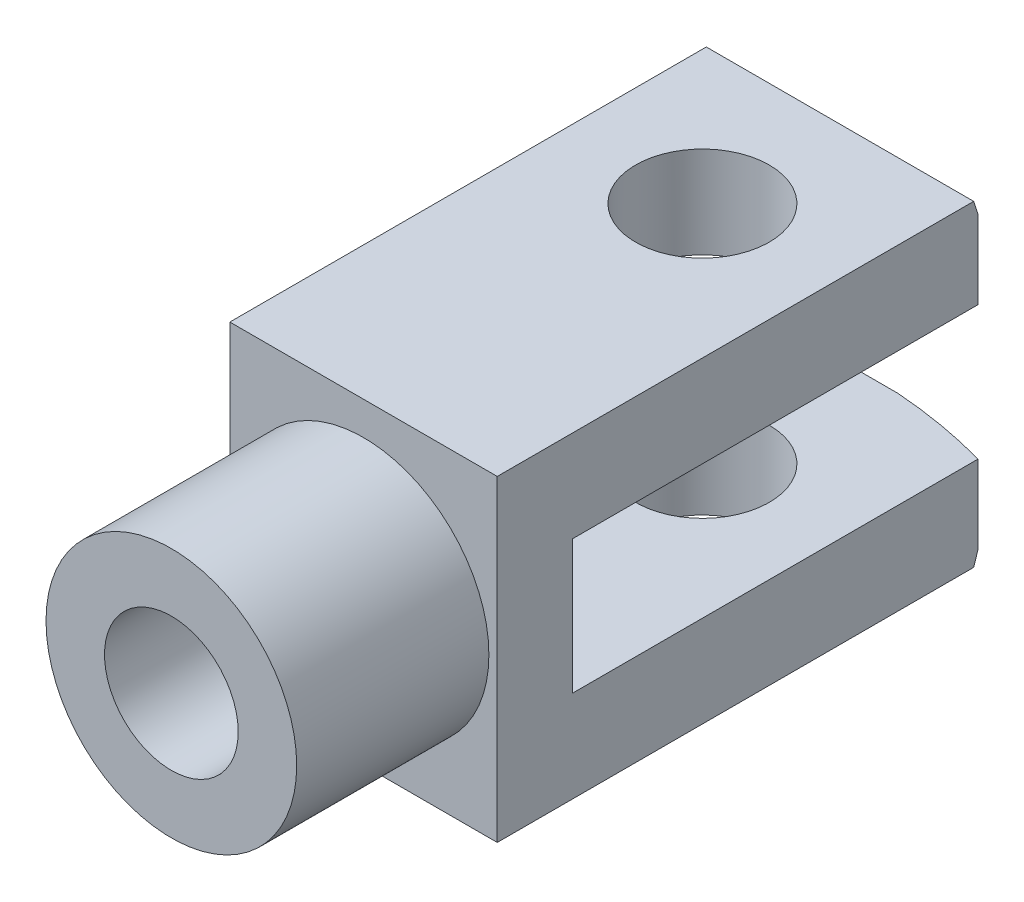
ISO-10303-21;
HEADER;
FILE_DESCRIPTION(('STEP AP214'),'2;1');
FILE_NAME('part.step','',(''),(''),'','','');
FILE_SCHEMA(('AUTOMOTIVE_DESIGN { 1 0 10303 214 1 1 1 1 }'));
ENDSEC;
DATA;
#1=APPLICATION_CONTEXT('core data for automotive mechanical design processes');
#2=APPLICATION_PROTOCOL_DEFINITION('international standard','automotive_design',2000,#1);
#3=PRODUCT_CONTEXT('',#1,'mechanical');
#4=PRODUCT('Part','Part','',(#3));
#5=PRODUCT_RELATED_PRODUCT_CATEGORY('part','',(#4));
#6=PRODUCT_DEFINITION_FORMATION('','',#4);
#7=PRODUCT_DEFINITION_CONTEXT('part definition',#1,'design');
#8=PRODUCT_DEFINITION('design','',#6,#7);
#9=PRODUCT_DEFINITION_SHAPE('','',#8);
#10=(LENGTH_UNIT() NAMED_UNIT(*) SI_UNIT(.MILLI.,.METRE.));
#11=(NAMED_UNIT(*) PLANE_ANGLE_UNIT() SI_UNIT($,.RADIAN.));
#12=(NAMED_UNIT(*) SI_UNIT($,.STERADIAN.) SOLID_ANGLE_UNIT());
#13=UNCERTAINTY_MEASURE_WITH_UNIT(LENGTH_MEASURE(1.E-05),#10,'distance_accuracy_value','');
#14=(GEOMETRIC_REPRESENTATION_CONTEXT(3) GLOBAL_UNCERTAINTY_ASSIGNED_CONTEXT((#13)) GLOBAL_UNIT_ASSIGNED_CONTEXT((#10,
#11,#12)) REPRESENTATION_CONTEXT('',''));
#15=CARTESIAN_POINT('',(0.,0.,0.));
#16=DIRECTION('',(0.,0.,1.));
#17=DIRECTION('',(1.,0.,0.));
#18=AXIS2_PLACEMENT_3D('',#15,#16,#17);
#19=CARTESIAN_POINT('',(8.00000000000002,0.,18.2051282051281));
#20=DIRECTION('',(0.,0.,1.));
#21=DIRECTION('',(1.,0.,0.));
#22=AXIS2_PLACEMENT_3D('',#19,#20,#21);
#23=PLANE('',#22);
#24=DIRECTION('',(1.,0.,0.));
#25=VECTOR('',#24,1.);
#26=CARTESIAN_POINT('',(69.8292176136682,8.,18.2051282051281));
#27=LINE('',#26,#25);
#28=CARTESIAN_POINT('',(-16.,8.,18.2051282051281));
#29=VERTEX_POINT('',#28);
#30=CARTESIAN_POINT('',(0.,8.,18.2051282051281));
#31=VERTEX_POINT('',#30);
#32=EDGE_CURVE('E148',#29,#31,#27,.T.);
#33=ORIENTED_EDGE('',*,*,#32,.T.);
#34=CARTESIAN_POINT('',(0.,0.,18.2051282051281));
#35=DIRECTION('',(0.,0.,1.));
#36=DIRECTION('',(1.,0.,0.));
#37=AXIS2_PLACEMENT_3D('',#34,#35,#36);
#38=CIRCLE('',#37,8.);
#39=CARTESIAN_POINT('',(0.,-8.,18.2051282051281));
#40=VERTEX_POINT('',#39);
#41=EDGE_CURVE('E56',#31,#40,#38,.T.);
#42=ORIENTED_EDGE('',*,*,#41,.T.);
#43=DIRECTION('',(-1.,0.,0.));
#44=VECTOR('',#43,1.);
#45=CARTESIAN_POINT('',(69.8292176136682,-8.,18.2051282051281));
#46=LINE('',#45,#44);
#47=CARTESIAN_POINT('',(-16.,-8.,18.2051282051281));
#48=VERTEX_POINT('',#47);
#49=EDGE_CURVE('E145',#40,#48,#46,.T.);
#50=ORIENTED_EDGE('',*,*,#49,.T.);
#51=DIRECTION('',(0.,-1.,0.));
#52=VECTOR('',#51,1.);
#53=CARTESIAN_POINT('',(-16.,0.,18.2051282051281));
#54=LINE('',#53,#52);
#55=EDGE_CURVE('E255',#29,#48,#54,.T.);
#56=ORIENTED_EDGE('',*,*,#55,.F.);
#57=EDGE_LOOP('',(#33,#42,#50,#56));
#58=FACE_BOUND('',#57,.T.);
#59=ADVANCED_FACE('F37',(#58),#23,.F.);
#60=CARTESIAN_POINT('',(69.8292176136682,-8.,18.2051282051281));
#61=DIRECTION('',(0.,-1.,0.));
#62=DIRECTION('',(0.,0.,-1.));
#63=AXIS2_PLACEMENT_3D('',#60,#61,#62);
#64=PLANE('',#63);
#65=ORIENTED_EDGE('',*,*,#49,.F.);
#66=CARTESIAN_POINT('',(16.,-8.,18.2051282051281));
#67=VERTEX_POINT('',#66);
#68=EDGE_CURVE('E156',#67,#40,#46,.T.);
#69=ORIENTED_EDGE('',*,*,#68,.F.);
#70=DIRECTION('',(0.,0.,1.));
#71=VECTOR('',#70,1.);
#72=CARTESIAN_POINT('',(16.,-8.,18.2051282051281));
#73=LINE('',#72,#71);
#74=CARTESIAN_POINT('',(16.,-8.,-30.3252081160688));
#75=VERTEX_POINT('',#74);
#76=EDGE_CURVE('E248',#75,#67,#73,.T.);
#77=ORIENTED_EDGE('',*,*,#76,.F.);
#78=CARTESIAN_POINT('',(0.,-8.,27.2051282051281));
#79=DIRECTION('',(0.,-1.,0.));
#80=DIRECTION('',(0.,0.,-1.));
#81=AXIS2_PLACEMENT_3D('',#78,#79,#80);
#82=CIRCLE('',#81,59.7138141239532);
#83=CARTESIAN_POINT('',(4.38521309113406,-8.,-32.3474494332527));
#84=VERTEX_POINT('',#83);
#85=EDGE_CURVE('E227',#84,#75,#82,.T.);
#86=ORIENTED_EDGE('',*,*,#85,.F.);
#87=DIRECTION('',(1.,0.,0.));
#88=VECTOR('',#87,1.);
#89=CARTESIAN_POINT('',(-35.,-8.,-32.3474494332527));
#90=LINE('',#89,#88);
#91=CARTESIAN_POINT('',(-4.38521309113406,-8.,-32.3474494332527));
#92=VERTEX_POINT('',#91);
#93=EDGE_CURVE('E64',#92,#84,#90,.T.);
#94=ORIENTED_EDGE('',*,*,#93,.F.);
#95=CARTESIAN_POINT('',(-16.,-8.,-30.3252081160688));
#96=VERTEX_POINT('',#95);
#97=EDGE_CURVE('E228',#96,#92,#82,.T.);
#98=ORIENTED_EDGE('',*,*,#97,.F.);
#99=DIRECTION('',(0.,0.,-1.));
#100=VECTOR('',#99,1.);
#101=CARTESIAN_POINT('',(-16.,-8.,18.2051282051281));
#102=LINE('',#101,#100);
#103=EDGE_CURVE('E159',#48,#96,#102,.T.);
#104=ORIENTED_EDGE('',*,*,#103,.F.);
#105=EDGE_LOOP('',(#65,#69,#77,#86,#94,#98,#104));
#106=FACE_BOUND('',#105,.T.);
#107=CARTESIAN_POINT('',(0.,-8.,-13.3474494332527));
#108=DIRECTION('',(0.,-1.,0.));
#109=DIRECTION('',(0.,0.,-1.));
#110=AXIS2_PLACEMENT_3D('',#107,#108,#109);
#111=CIRCLE('',#110,8.);
#112=CARTESIAN_POINT('',(0.,-8.,-21.3474494332527));
#113=VERTEX_POINT('',#112);
#114=EDGE_CURVE('E346',#113,#113,#111,.T.);
#115=ORIENTED_EDGE('',*,*,#114,.T.);
#116=EDGE_LOOP('',(#115));
#117=FACE_BOUND('',#116,.T.);
#118=ADVANCED_FACE('F153',(#106,#117),#64,.F.);
#119=CARTESIAN_POINT('',(69.8292176136682,8.,18.2051282051281));
#120=DIRECTION('',(0.,1.,0.));
#121=DIRECTION('',(0.,0.,1.));
#122=AXIS2_PLACEMENT_3D('',#119,#120,#121);
#123=PLANE('',#122);
#124=CARTESIAN_POINT('',(16.,8.,18.2051282051281));
#125=VERTEX_POINT('',#124);
#126=EDGE_CURVE('E258',#31,#125,#27,.T.);
#127=ORIENTED_EDGE('',*,*,#126,.F.);
#128=ORIENTED_EDGE('',*,*,#32,.F.);
#129=DIRECTION('',(0.,0.,1.));
#130=VECTOR('',#129,1.);
#131=CARTESIAN_POINT('',(-16.,8.,18.2051282051281));
#132=LINE('',#131,#130);
#133=CARTESIAN_POINT('',(-16.,8.,-30.3252081160688));
#134=VERTEX_POINT('',#133);
#135=EDGE_CURVE('E257',#134,#29,#132,.T.);
#136=ORIENTED_EDGE('',*,*,#135,.F.);
#137=CARTESIAN_POINT('',(0.,8.,27.2051282051281));
#138=DIRECTION('',(0.,1.,0.));
#139=DIRECTION('',(0.,0.,1.));
#140=AXIS2_PLACEMENT_3D('',#137,#138,#139);
#141=CIRCLE('',#140,59.7138141239532);
#142=CARTESIAN_POINT('',(-4.38521309113406,8.,-32.3474494332527));
#143=VERTEX_POINT('',#142);
#144=EDGE_CURVE('E233',#143,#134,#141,.T.);
#145=ORIENTED_EDGE('',*,*,#144,.F.);
#146=DIRECTION('',(1.,0.,0.));
#147=VECTOR('',#146,1.);
#148=CARTESIAN_POINT('',(-35.,8.,-32.3474494332527));
#149=LINE('',#148,#147);
#150=CARTESIAN_POINT('',(4.38521309113406,8.,-32.3474494332527));
#151=VERTEX_POINT('',#150);
#152=EDGE_CURVE('E215',#151,#143,#149,.F.);
#153=ORIENTED_EDGE('',*,*,#152,.F.);
#154=CARTESIAN_POINT('',(16.,8.,-30.3252081160688));
#155=VERTEX_POINT('',#154);
#156=EDGE_CURVE('E235',#155,#151,#141,.T.);
#157=ORIENTED_EDGE('',*,*,#156,.F.);
#158=DIRECTION('',(0.,0.,-1.));
#159=VECTOR('',#158,1.);
#160=CARTESIAN_POINT('',(16.,8.,18.2051282051281));
#161=LINE('',#160,#159);
#162=EDGE_CURVE('E245',#125,#155,#161,.T.);
#163=ORIENTED_EDGE('',*,*,#162,.F.);
#164=EDGE_LOOP('',(#127,#128,#136,#145,#153,#157,#163));
#165=FACE_BOUND('',#164,.T.);
#166=CARTESIAN_POINT('',(0.,8.,-13.3474494332527));
#167=DIRECTION('',(0.,1.,0.));
#168=DIRECTION('',(0.,0.,1.));
#169=AXIS2_PLACEMENT_3D('',#166,#167,#168);
#170=CIRCLE('',#169,8.);
#171=CARTESIAN_POINT('',(0.,8.,-5.3474494332527));
#172=VERTEX_POINT('',#171);
#173=EDGE_CURVE('E341',#172,#172,#170,.T.);
#174=ORIENTED_EDGE('',*,*,#173,.T.);
#175=EDGE_LOOP('',(#174));
#176=FACE_BOUND('',#175,.T.);
#177=ADVANCED_FACE('F266',(#165,#176),#123,.F.);
#178=CARTESIAN_POINT('',(60.0251154272219,18.9679364750024,50.2051282051281));
#179=DIRECTION('',(0.,1.,0.));
#180=DIRECTION('',(0.,0.,1.));
#181=AXIS2_PLACEMENT_3D('',#178,#179,#180);
#182=PLANE('',#181);
#183=CARTESIAN_POINT('',(0.,18.9679364750024,-13.3474494332527));
#184=DIRECTION('',(0.,-1.,0.));
#185=DIRECTION('',(0.,0.,-1.));
#186=AXIS2_PLACEMENT_3D('',#183,#184,#185);
#187=CIRCLE('',#186,8.);
#188=CARTESIAN_POINT('',(0.,18.9679364750024,-21.3474494332527));
#189=VERTEX_POINT('',#188);
#190=EDGE_CURVE('E338',#189,#189,#187,.T.);
#191=ORIENTED_EDGE('',*,*,#190,.T.);
#192=EDGE_LOOP('',(#191));
#193=FACE_BOUND('',#192,.T.);
#194=DIRECTION('',(0.,0.,-1.));
#195=VECTOR('',#194,1.);
#196=CARTESIAN_POINT('',(16.,18.9679364750024,50.2051282051281));
#197=LINE('',#196,#195);
#198=CARTESIAN_POINT('',(16.,18.9679364750024,27.2051282051281));
#199=VERTEX_POINT('',#198);
#200=CARTESIAN_POINT('',(16.,18.9679364750024,-29.810017933908));
#201=VERTEX_POINT('',#200);
#202=EDGE_CURVE('E241',#199,#201,#197,.T.);
#203=ORIENTED_EDGE('',*,*,#202,.T.);
#204=DIRECTION('',(1.,0.,0.));
#205=VECTOR('',#204,1.);
#206=CARTESIAN_POINT('',(-35.,18.9679364750024,-29.810017933908));
#207=LINE('',#206,#205);
#208=CARTESIAN_POINT('',(-16.,18.9679364750024,-29.810017933908));
#209=VERTEX_POINT('',#208);
#210=EDGE_CURVE('E281',#201,#209,#207,.F.);
#211=ORIENTED_EDGE('',*,*,#210,.T.);
#212=DIRECTION('',(0.,0.,1.));
#213=VECTOR('',#212,1.);
#214=CARTESIAN_POINT('',(-16.,18.9679364750024,50.2051282051281));
#215=LINE('',#214,#213);
#216=CARTESIAN_POINT('',(-16.,18.9679364750024,27.2051282051281));
#217=VERTEX_POINT('',#216);
#218=EDGE_CURVE('E253',#209,#217,#215,.T.);
#219=ORIENTED_EDGE('',*,*,#218,.T.);
#220=DIRECTION('',(1.,0.,0.));
#221=VECTOR('',#220,1.);
#222=CARTESIAN_POINT('',(15.,18.9679364750024,27.2051282051281));
#223=LINE('',#222,#221);
#224=EDGE_CURVE('E174',#217,#199,#223,.T.);
#225=ORIENTED_EDGE('',*,*,#224,.T.);
#226=EDGE_LOOP('',(#203,#211,#219,#225));
#227=FACE_BOUND('',#226,.T.);
#228=ADVANCED_FACE('F280',(#193,#227),#182,.T.);
#229=CARTESIAN_POINT('',(60.0251154272219,-18.9679364750024,50.2051282051281));
#230=DIRECTION('',(0.,-1.,0.));
#231=DIRECTION('',(0.,0.,-1.));
#232=AXIS2_PLACEMENT_3D('',#229,#230,#231);
#233=PLANE('',#232);
#234=CARTESIAN_POINT('',(0.,-18.9679364750024,-13.3474494332527));
#235=DIRECTION('',(0.,-1.,0.));
#236=DIRECTION('',(0.,0.,-1.));
#237=AXIS2_PLACEMENT_3D('',#234,#235,#236);
#238=CIRCLE('',#237,8.);
#239=CARTESIAN_POINT('',(0.,-18.9679364750024,-21.3474494332527));
#240=VERTEX_POINT('',#239);
#241=EDGE_CURVE('E149',#240,#240,#238,.T.);
#242=ORIENTED_EDGE('',*,*,#241,.F.);
#243=EDGE_LOOP('',(#242));
#244=FACE_BOUND('',#243,.T.);
#245=DIRECTION('',(0.,0.,-1.));
#246=VECTOR('',#245,1.);
#247=CARTESIAN_POINT('',(-16.,-18.9679364750024,50.2051282051281));
#248=LINE('',#247,#246);
#249=CARTESIAN_POINT('',(-16.,-18.9679364750024,27.2051282051281));
#250=VERTEX_POINT('',#249);
#251=CARTESIAN_POINT('',(-16.,-18.9679364750024,-29.810017933908));
#252=VERTEX_POINT('',#251);
#253=EDGE_CURVE('E182',#250,#252,#248,.T.);
#254=ORIENTED_EDGE('',*,*,#253,.T.);
#255=DIRECTION('',(1.,0.,0.));
#256=VECTOR('',#255,1.);
#257=CARTESIAN_POINT('',(-35.,-18.9679364750024,-29.810017933908));
#258=LINE('',#257,#256);
#259=CARTESIAN_POINT('',(16.,-18.9679364750024,-29.810017933908));
#260=VERTEX_POINT('',#259);
#261=EDGE_CURVE('E224',#252,#260,#258,.T.);
#262=ORIENTED_EDGE('',*,*,#261,.T.);
#263=DIRECTION('',(0.,0.,1.));
#264=VECTOR('',#263,1.);
#265=CARTESIAN_POINT('',(16.,-18.9679364750024,50.2051282051281));
#266=LINE('',#265,#264);
#267=CARTESIAN_POINT('',(16.,-18.9679364750024,27.2051282051281));
#268=VERTEX_POINT('',#267);
#269=EDGE_CURVE('E180',#260,#268,#266,.T.);
#270=ORIENTED_EDGE('',*,*,#269,.T.);
#271=DIRECTION('',(-1.,0.,0.));
#272=VECTOR('',#271,1.);
#273=CARTESIAN_POINT('',(15.,-18.9679364750024,27.2051282051281));
#274=LINE('',#273,#272);
#275=EDGE_CURVE('E177',#268,#250,#274,.T.);
#276=ORIENTED_EDGE('',*,*,#275,.T.);
#277=EDGE_LOOP('',(#254,#262,#270,#276));
#278=FACE_BOUND('',#277,.T.);
#279=ADVANCED_FACE('F292',(#244,#278),#233,.T.);
#280=CARTESIAN_POINT('',(16.,-26.438334931354,50.2051282051281));
#281=DIRECTION('',(1.,0.,0.));
#282=DIRECTION('',(0.,0.,-1.));
#283=AXIS2_PLACEMENT_3D('',#280,#281,#282);
#284=PLANE('',#283);
#285=DIRECTION('',(0.,1.,0.));
#286=VECTOR('',#285,1.);
#287=CARTESIAN_POINT('',(16.,-32.0320635249976,-30.3252081160688));
#288=LINE('',#287,#286);
#289=CARTESIAN_POINT('',(16.,17.3427191104897,-30.3252081160688));
#290=VERTEX_POINT('',#289);
#291=EDGE_CURVE('E234',#155,#290,#288,.T.);
#292=ORIENTED_EDGE('',*,*,#291,.T.);
#293=CARTESIAN_POINT('',(16.,0.,27.2051282051281));
#294=DIRECTION('',(1.,0.,0.));
#295=DIRECTION('',(0.,0.,-1.));
#296=AXIS2_PLACEMENT_3D('',#293,#294,#295);
#297=CIRCLE('',#296,60.0875153702945);
#298=EDGE_CURVE('E273',#290,#201,#297,.T.);
#299=ORIENTED_EDGE('',*,*,#298,.T.);
#300=ORIENTED_EDGE('',*,*,#202,.F.);
#301=DIRECTION('',(0.,-1.,0.));
#302=VECTOR('',#301,1.);
#303=CARTESIAN_POINT('',(16.,0.,27.2051282051281));
#304=LINE('',#303,#302);
#305=EDGE_CURVE('E238',#199,#268,#304,.T.);
#306=ORIENTED_EDGE('',*,*,#305,.T.);
#307=ORIENTED_EDGE('',*,*,#269,.F.);
#308=CARTESIAN_POINT('',(16.,-17.3427191104897,-30.3252081160688));
#309=VERTEX_POINT('',#308);
#310=EDGE_CURVE('E276',#260,#309,#297,.T.);
#311=ORIENTED_EDGE('',*,*,#310,.T.);
#312=EDGE_CURVE('E231',#309,#75,#288,.T.);
#313=ORIENTED_EDGE('',*,*,#312,.T.);
#314=ORIENTED_EDGE('',*,*,#76,.T.);
#315=DIRECTION('',(0.,1.,0.));
#316=VECTOR('',#315,1.);
#317=CARTESIAN_POINT('',(16.,0.,18.2051282051281));
#318=LINE('',#317,#316);
#319=EDGE_CURVE('E164',#67,#125,#318,.T.);
#320=ORIENTED_EDGE('',*,*,#319,.T.);
#321=ORIENTED_EDGE('',*,*,#162,.T.);
#322=EDGE_LOOP('',(#292,#299,#300,#306,#307,#311,#313,#314,#320,#321));
#323=FACE_BOUND('',#322,.T.);
#324=ADVANCED_FACE('F264',(#323),#284,.T.);
#325=CARTESIAN_POINT('',(-16.,-26.438334931354,50.2051282051281));
#326=DIRECTION('',(-1.,0.,0.));
#327=DIRECTION('',(0.,0.,1.));
#328=AXIS2_PLACEMENT_3D('',#325,#326,#327);
#329=PLANE('',#328);
#330=ORIENTED_EDGE('',*,*,#218,.F.);
#331=CARTESIAN_POINT('',(-16.,0.,27.2051282051281));
#332=DIRECTION('',(-1.,0.,0.));
#333=DIRECTION('',(0.,0.,1.));
#334=AXIS2_PLACEMENT_3D('',#331,#332,#333);
#335=CIRCLE('',#334,60.0875153702945);
#336=CARTESIAN_POINT('',(-16.,17.3427191104897,-30.3252081160688));
#337=VERTEX_POINT('',#336);
#338=EDGE_CURVE('E275',#209,#337,#335,.T.);
#339=ORIENTED_EDGE('',*,*,#338,.T.);
#340=DIRECTION('',(0.,1.,0.));
#341=VECTOR('',#340,1.);
#342=CARTESIAN_POINT('',(-16.,-32.0320635249976,-30.3252081160688));
#343=LINE('',#342,#341);
#344=EDGE_CURVE('E187',#337,#134,#343,.F.);
#345=ORIENTED_EDGE('',*,*,#344,.T.);
#346=ORIENTED_EDGE('',*,*,#135,.T.);
#347=ORIENTED_EDGE('',*,*,#55,.T.);
#348=ORIENTED_EDGE('',*,*,#103,.T.);
#349=CARTESIAN_POINT('',(-16.,-17.3427191104897,-30.3252081160688));
#350=VERTEX_POINT('',#349);
#351=EDGE_CURVE('E185',#96,#350,#343,.F.);
#352=ORIENTED_EDGE('',*,*,#351,.T.);
#353=EDGE_CURVE('E223',#350,#252,#335,.T.);
#354=ORIENTED_EDGE('',*,*,#353,.T.);
#355=ORIENTED_EDGE('',*,*,#253,.F.);
#356=DIRECTION('',(0.,1.,0.));
#357=VECTOR('',#356,1.);
#358=CARTESIAN_POINT('',(-16.,0.,27.2051282051281));
#359=LINE('',#358,#357);
#360=EDGE_CURVE('E250',#250,#217,#359,.T.);
#361=ORIENTED_EDGE('',*,*,#360,.T.);
#362=EDGE_LOOP('',(#330,#339,#345,#346,#347,#348,#352,#354,#355,#361));
#363=FACE_BOUND('',#362,.T.);
#364=ADVANCED_FACE('F294',(#363),#329,.T.);
#365=CARTESIAN_POINT('',(0.,-32.0320635249976,27.2051282051281));
#366=DIRECTION('',(0.,1.,0.));
#367=DIRECTION('',(0.,0.,1.));
#368=AXIS2_PLACEMENT_3D('',#365,#366,#367);
#369=CYLINDRICAL_SURFACE('',#368,59.7138141239532);
#370=ORIENTED_EDGE('',*,*,#97,.T.);
#371=CARTESIAN_POINT('',(-4.38521309113406,-8.,-32.3474494332527));
#372=CARTESIAN_POINT('',(-4.6613952570537,-8.15159909207649,-32.3270986302882));
#373=CARTESIAN_POINT('',(-4.93330097802808,-8.31043984417306,-32.3051584108015));
#374=CARTESIAN_POINT('',(-5.46963636492281,-8.63950797812877,-32.2582683319508));
#375=CARTESIAN_POINT('',(-5.73407101726686,-8.80972749719443,-32.2333205414518));
#376=CARTESIAN_POINT('',(-6.25643635173538,-9.15835226678881,-32.1806046050951));
#377=CARTESIAN_POINT('',(-6.51437806571616,-9.33674194326113,-32.1528417120077));
#378=CARTESIAN_POINT('',(-7.02530285301193,-9.70013238309182,-32.0945414534503));
#379=CARTESIAN_POINT('',(-7.27828494230316,-9.88513443824149,-32.064003544037));
#380=CARTESIAN_POINT('',(-8.02912790845998,-10.4463309662254,-31.9685736513823));
#381=CARTESIAN_POINT('',(-8.52084378946619,-10.8300563323118,-31.899665338932));
#382=CARTESIAN_POINT('',(-9.49273827467102,-11.610281545124,-31.7513727121725));
#383=CARTESIAN_POINT('',(-9.97291041684483,-12.0067882687778,-31.6719826846557));
#384=CARTESIAN_POINT('',(-10.9238717114134,-12.8076254391585,-31.5029763278052));
#385=CARTESIAN_POINT('',(-11.3946710579423,-13.2119463233423,-31.413371912415));
#386=CARTESIAN_POINT('',(-12.3292783610038,-14.0259941385155,-31.2239372787199));
#387=CARTESIAN_POINT('',(-12.7930878738257,-14.435719826855,-31.1241093764497));
#388=CARTESIAN_POINT('',(-13.716799869145,-15.2603029859376,-30.9138383403378));
#389=CARTESIAN_POINT('',(-14.1766820135376,-15.6751736991684,-30.803357928812));
#390=CARTESIAN_POINT('',(-15.091710016743,-16.5074053919333,-30.5720480580876));
#391=CARTESIAN_POINT('',(-15.5468550838411,-16.9247667699624,-30.4512168991411));
#392=CARTESIAN_POINT('',(-16.,-17.3427191104897,-30.3252081160688));
#393=B_SPLINE_CURVE_WITH_KNOTS('',3,(#371,#372,#373,#374,#375,#376,#377,#378,#379,#380,#381,
#382,#383,#384,#385,#386,#387,#388,#389,#390,#391,#392),.UNSPECIFIED.,.F.,.F.,(4,2,2,2,2,2,2,2,
2,2,4),(0.,0.946783466325601,1.89291933079226,2.83732117609935,3.78190853872514,
5.66394600524988,7.54701357103961,9.42790679858416,11.3083748660992,13.1956804061073,
15.0832964662787),.UNSPECIFIED.);
#394=EDGE_CURVE('E217',#92,#350,#393,.T.);
#395=ORIENTED_EDGE('',*,*,#394,.T.);
#396=ORIENTED_EDGE('',*,*,#351,.F.);
#397=EDGE_LOOP('',(#370,#395,#396));
#398=FACE_BOUND('',#397,.T.);
#399=ADVANCED_FACE('F192',(#398),#369,.T.);
#400=ORIENTED_EDGE('',*,*,#312,.F.);
#401=CARTESIAN_POINT('',(16.,-17.3427191104897,-30.3252081160688));
#402=CARTESIAN_POINT('',(15.5468550838411,-16.9247667699624,-30.4512168991411));
#403=CARTESIAN_POINT('',(15.091710016743,-16.5074053919333,-30.5720480580876));
#404=CARTESIAN_POINT('',(14.1766820135376,-15.6751736991685,-30.803357928812));
#405=CARTESIAN_POINT('',(13.716799869145,-15.2603029859376,-30.9138383403378));
#406=CARTESIAN_POINT('',(12.7930878738257,-14.435719826855,-31.1241093764497));
#407=CARTESIAN_POINT('',(12.3292783610039,-14.0259941385155,-31.2239372787199));
#408=CARTESIAN_POINT('',(11.3946710579423,-13.2119463233423,-31.413371912415));
#409=CARTESIAN_POINT('',(10.9238717114134,-12.8076254391585,-31.5029763278052));
#410=CARTESIAN_POINT('',(9.97291041684483,-12.0067882687778,-31.6719826846557));
#411=CARTESIAN_POINT('',(9.49273827467103,-11.610281545124,-31.7513727121725));
#412=CARTESIAN_POINT('',(8.5208437894662,-10.8300563323118,-31.899665338932));
#413=CARTESIAN_POINT('',(8.02912790846,-10.4463309662253,-31.9685736513823));
#414=CARTESIAN_POINT('',(7.27828494230317,-9.88513443824149,-32.064003544037));
#415=CARTESIAN_POINT('',(7.02530285301193,-9.70013238309183,-32.0945414534503));
#416=CARTESIAN_POINT('',(6.51437806571616,-9.33674194326114,-32.1528417120077));
#417=CARTESIAN_POINT('',(6.25643635173538,-9.15835226678882,-32.1806046050951));
#418=CARTESIAN_POINT('',(5.73407101726685,-8.80972749719445,-32.2333205414518));
#419=CARTESIAN_POINT('',(5.4696363649228,-8.63950797812878,-32.2582683319508));
#420=CARTESIAN_POINT('',(4.93330097802808,-8.31043984417306,-32.3051584108015));
#421=CARTESIAN_POINT('',(4.66139525705371,-8.15159909207649,-32.3270986302882));
#422=CARTESIAN_POINT('',(4.38521309113407,-7.99999999999997,-32.3474494332527));
#423=B_SPLINE_CURVE_WITH_KNOTS('',3,(#401,#402,#403,#404,#405,#406,#407,#408,#409,#410,#411,
#412,#413,#414,#415,#416,#417,#418,#419,#420,#421,#422),.UNSPECIFIED.,.F.,.F.,(4,2,2,2,2,2,2,2,
2,2,4),(0.,1.88761606017134,3.77492160017942,5.6553896676945,7.53628289523907,9.4193504610288,
11.3013879275535,12.2459752901793,13.1903771354864,14.1365129999531,15.0832964662787),.UNSPECIFIED.);
#424=EDGE_CURVE('E209',#309,#84,#423,.T.);
#425=ORIENTED_EDGE('',*,*,#424,.T.);
#426=ORIENTED_EDGE('',*,*,#85,.T.);
#427=EDGE_LOOP('',(#400,#425,#426));
#428=FACE_BOUND('',#427,.T.);
#429=ADVANCED_FACE('F309',(#428),#369,.T.);
#430=ORIENTED_EDGE('',*,*,#156,.T.);
#431=CARTESIAN_POINT('',(4.38521309113406,8.,-32.3474494332527));
#432=CARTESIAN_POINT('',(4.66139525705371,8.15159909207647,-32.3270986302882));
#433=CARTESIAN_POINT('',(4.93330097802809,8.31043984417304,-32.3051584108015));
#434=CARTESIAN_POINT('',(5.4696363649228,8.63950797812877,-32.2582683319508));
#435=CARTESIAN_POINT('',(5.73407101726685,8.80972749719446,-32.2333205414518));
#436=CARTESIAN_POINT('',(6.25643635173537,9.15835226678884,-32.1806046050951));
#437=CARTESIAN_POINT('',(6.51437806571616,9.33674194326115,-32.1528417120077));
#438=CARTESIAN_POINT('',(7.02530285301194,9.70013238309182,-32.0945414534503));
#439=CARTESIAN_POINT('',(7.27828494230318,9.88513443824148,-32.064003544037));
#440=CARTESIAN_POINT('',(8.02912790846,10.4463309662253,-31.9685736513823));
#441=CARTESIAN_POINT('',(8.52084378946619,10.8300563323118,-31.899665338932));
#442=CARTESIAN_POINT('',(9.49273827467104,11.610281545124,-31.7513727121725));
#443=CARTESIAN_POINT('',(9.97291041684486,12.0067882687778,-31.6719826846557));
#444=CARTESIAN_POINT('',(10.9238717114134,12.8076254391585,-31.5029763278052));
#445=CARTESIAN_POINT('',(11.3946710579423,13.2119463233423,-31.413371912415));
#446=CARTESIAN_POINT('',(12.3292783610039,14.0259941385155,-31.2239372787199));
#447=CARTESIAN_POINT('',(12.7930878738257,14.435719826855,-31.1241093764497));
#448=CARTESIAN_POINT('',(13.716799869145,15.2603029859376,-30.9138383403378));
#449=CARTESIAN_POINT('',(14.1766820135376,15.6751736991685,-30.803357928812));
#450=CARTESIAN_POINT('',(15.091710016743,16.5074053919333,-30.5720480580876));
#451=CARTESIAN_POINT('',(15.5468550838411,16.9247667699624,-30.4512168991411));
#452=CARTESIAN_POINT('',(16.,17.3427191104897,-30.3252081160688));
#453=B_SPLINE_CURVE_WITH_KNOTS('',3,(#431,#432,#433,#434,#435,#436,#437,#438,#439,#440,#441,
#442,#443,#444,#445,#446,#447,#448,#449,#450,#451,#452),.UNSPECIFIED.,.F.,.F.,(4,2,2,2,2,2,2,2,
2,2,4),(0.,0.946783466325601,1.89291933079226,2.83732117609935,3.78190853872515,
5.66394600524989,7.54701357103962,9.42790679858418,11.3083748660993,13.1956804061073,
15.0832964662787),.UNSPECIFIED.);
#454=EDGE_CURVE('E12',#151,#290,#453,.T.);
#455=ORIENTED_EDGE('',*,*,#454,.T.);
#456=ORIENTED_EDGE('',*,*,#291,.F.);
#457=EDGE_LOOP('',(#430,#455,#456));
#458=FACE_BOUND('',#457,.T.);
#459=ADVANCED_FACE('F271',(#458),#369,.T.);
#460=ORIENTED_EDGE('',*,*,#344,.F.);
#461=CARTESIAN_POINT('',(-16.,17.3427191104897,-30.3252081160688));
#462=CARTESIAN_POINT('',(-15.5468550838411,16.9247667699624,-30.4512168991411));
#463=CARTESIAN_POINT('',(-15.091710016743,16.5074053919333,-30.5720480580876));
#464=CARTESIAN_POINT('',(-14.1766820135376,15.6751736991685,-30.803357928812));
#465=CARTESIAN_POINT('',(-13.716799869145,15.2603029859376,-30.9138383403378));
#466=CARTESIAN_POINT('',(-12.7930878738257,14.435719826855,-31.1241093764497));
#467=CARTESIAN_POINT('',(-12.3292783610039,14.0259941385155,-31.2239372787199));
#468=CARTESIAN_POINT('',(-11.3946710579423,13.2119463233423,-31.413371912415));
#469=CARTESIAN_POINT('',(-10.9238717114134,12.8076254391585,-31.5029763278052));
#470=CARTESIAN_POINT('',(-9.97291041684483,12.0067882687778,-31.6719826846557));
#471=CARTESIAN_POINT('',(-9.49273827467104,11.610281545124,-31.7513727121725));
#472=CARTESIAN_POINT('',(-8.5208437894662,10.8300563323118,-31.899665338932));
#473=CARTESIAN_POINT('',(-8.02912790845998,10.4463309662254,-31.9685736513823));
#474=CARTESIAN_POINT('',(-7.27828494230315,9.88513443824151,-32.064003544037));
#475=CARTESIAN_POINT('',(-7.02530285301191,9.70013238309184,-32.0945414534503));
#476=CARTESIAN_POINT('',(-6.51437806571615,9.33674194326114,-32.1528417120077));
#477=CARTESIAN_POINT('',(-6.25643635173538,9.15835226678882,-32.1806046050951));
#478=CARTESIAN_POINT('',(-5.73407101726687,8.80972749719443,-32.2333205414518));
#479=CARTESIAN_POINT('',(-5.46963636492282,8.63950797812876,-32.2582683319508));
#480=CARTESIAN_POINT('',(-4.9333009780281,8.31043984417303,-32.3051584108015));
#481=CARTESIAN_POINT('',(-4.66139525705372,8.15159909207646,-32.3270986302882));
#482=CARTESIAN_POINT('',(-4.38521309113409,7.99999999999997,-32.3474494332527));
#483=B_SPLINE_CURVE_WITH_KNOTS('',3,(#461,#462,#463,#464,#465,#466,#467,#468,#469,#470,#471,
#472,#473,#474,#475,#476,#477,#478,#479,#480,#481,#482),.UNSPECIFIED.,.F.,.F.,(4,2,2,2,2,2,2,2,
2,2,4),(0.,1.88761606017134,3.77492160017942,5.65538966769449,7.53628289523905,9.41935046102878,
11.3013879275535,12.2459752901793,13.1903771354864,14.1365129999531,15.0832964662787),.UNSPECIFIED.);
#484=EDGE_CURVE('E50',#337,#143,#483,.T.);
#485=ORIENTED_EDGE('',*,*,#484,.T.);
#486=ORIENTED_EDGE('',*,*,#144,.T.);
#487=EDGE_LOOP('',(#460,#485,#486));
#488=FACE_BOUND('',#487,.T.);
#489=ADVANCED_FACE('F300',(#488),#369,.T.);
#490=CARTESIAN_POINT('',(15.,0.,27.2051282051281));
#491=DIRECTION('',(0.,0.,-1.));
#492=DIRECTION('',(-1.,0.,0.));
#493=AXIS2_PLACEMENT_3D('',#490,#491,#492);
#494=PLANE('',#493);
#495=CARTESIAN_POINT('',(0.,0.,27.2051282051281));
#496=DIRECTION('',(0.,0.,-1.));
#497=DIRECTION('',(-1.,0.,0.));
#498=AXIS2_PLACEMENT_3D('',#495,#496,#497);
#499=CIRCLE('',#498,15.);
#500=CARTESIAN_POINT('',(-15.,0.,27.2051282051281));
#501=VERTEX_POINT('',#500);
#502=EDGE_CURVE('E165',#501,#501,#499,.T.);
#503=ORIENTED_EDGE('',*,*,#502,.T.);
#504=EDGE_LOOP('',(#503));
#505=FACE_BOUND('',#504,.T.);
#506=ORIENTED_EDGE('',*,*,#360,.F.);
#507=ORIENTED_EDGE('',*,*,#275,.F.);
#508=ORIENTED_EDGE('',*,*,#305,.F.);
#509=ORIENTED_EDGE('',*,*,#224,.F.);
#510=EDGE_LOOP('',(#506,#507,#508,#509));
#511=FACE_BOUND('',#510,.T.);
#512=ADVANCED_FACE('F286',(#505,#511),#494,.F.);
#513=ORIENTED_EDGE('',*,*,#68,.T.);
#514=EDGE_CURVE('E134',#40,#31,#38,.T.);
#515=ORIENTED_EDGE('',*,*,#514,.T.);
#516=ORIENTED_EDGE('',*,*,#126,.T.);
#517=ORIENTED_EDGE('',*,*,#319,.F.);
#518=EDGE_LOOP('',(#513,#515,#516,#517));
#519=FACE_BOUND('',#518,.T.);
#520=ADVANCED_FACE('F162',(#519),#23,.F.);
#521=CARTESIAN_POINT('',(0.,0.,-124.102564102564));
#522=DIRECTION('',(0.,0.,-1.));
#523=DIRECTION('',(-1.,0.,0.));
#524=AXIS2_PLACEMENT_3D('',#521,#522,#523);
#525=CYLINDRICAL_SURFACE('',#524,15.);
#526=ORIENTED_EDGE('',*,*,#502,.F.);
#527=EDGE_LOOP('',(#526));
#528=FACE_BOUND('',#527,.T.);
#529=CARTESIAN_POINT('',(0.,0.,50.2051282051281));
#530=DIRECTION('',(0.,0.,-1.));
#531=DIRECTION('',(-1.,0.,0.));
#532=AXIS2_PLACEMENT_3D('',#529,#530,#531);
#533=CIRCLE('',#532,15.);
#534=CARTESIAN_POINT('',(-15.,0.,50.2051282051281));
#535=VERTEX_POINT('',#534);
#536=EDGE_CURVE('E167',#535,#535,#533,.T.);
#537=ORIENTED_EDGE('',*,*,#536,.T.);
#538=EDGE_LOOP('',(#537));
#539=FACE_BOUND('',#538,.T.);
#540=ADVANCED_FACE('F39',(#528,#539),#525,.T.);
#541=CARTESIAN_POINT('',(15.,0.,50.2051282051281));
#542=DIRECTION('',(0.,0.,-1.));
#543=DIRECTION('',(-1.,0.,0.));
#544=AXIS2_PLACEMENT_3D('',#541,#542,#543);
#545=PLANE('',#544);
#546=CARTESIAN_POINT('',(0.,0.,50.2051282051281));
#547=DIRECTION('',(0.,0.,1.));
#548=DIRECTION('',(1.,0.,0.));
#549=AXIS2_PLACEMENT_3D('',#546,#547,#548);
#550=CIRCLE('',#549,8.);
#551=CARTESIAN_POINT('',(8.,0.,50.2051282051281));
#552=VERTEX_POINT('',#551);
#553=EDGE_CURVE('E139',#552,#552,#550,.T.);
#554=ORIENTED_EDGE('',*,*,#553,.F.);
#555=EDGE_LOOP('',(#554));
#556=FACE_BOUND('',#555,.T.);
#557=ORIENTED_EDGE('',*,*,#536,.F.);
#558=EDGE_LOOP('',(#557));
#559=FACE_BOUND('',#558,.T.);
#560=ADVANCED_FACE('F200',(#556,#559),#545,.F.);
#561=CARTESIAN_POINT('',(-35.,0.,27.2051282051281));
#562=DIRECTION('',(1.,0.,0.));
#563=DIRECTION('',(0.,0.,-1.));
#564=AXIS2_PLACEMENT_3D('',#561,#562,#563);
#565=CYLINDRICAL_SURFACE('',#564,60.0875153702945);
#566=ORIENTED_EDGE('',*,*,#152,.T.);
#567=ORIENTED_EDGE('',*,*,#484,.F.);
#568=ORIENTED_EDGE('',*,*,#338,.F.);
#569=ORIENTED_EDGE('',*,*,#210,.F.);
#570=ORIENTED_EDGE('',*,*,#298,.F.);
#571=ORIENTED_EDGE('',*,*,#454,.F.);
#572=EDGE_LOOP('',(#566,#567,#568,#569,#570,#571));
#573=FACE_BOUND('',#572,.T.);
#574=ADVANCED_FACE('F195',(#573),#565,.T.);
#575=ORIENTED_EDGE('',*,*,#353,.F.);
#576=ORIENTED_EDGE('',*,*,#394,.F.);
#577=ORIENTED_EDGE('',*,*,#93,.T.);
#578=ORIENTED_EDGE('',*,*,#424,.F.);
#579=ORIENTED_EDGE('',*,*,#310,.F.);
#580=ORIENTED_EDGE('',*,*,#261,.F.);
#581=EDGE_LOOP('',(#575,#576,#577,#578,#579,#580));
#582=FACE_BOUND('',#581,.T.);
#583=ADVANCED_FACE('F199',(#582),#565,.T.);
#584=CARTESIAN_POINT('',(0.,18.9679364750024,-13.3474494332527));
#585=DIRECTION('',(0.,-1.,0.));
#586=DIRECTION('',(0.,0.,-1.));
#587=AXIS2_PLACEMENT_3D('',#584,#585,#586);
#588=CYLINDRICAL_SURFACE('',#587,8.);
#589=ORIENTED_EDGE('',*,*,#241,.T.);
#590=EDGE_LOOP('',(#589));
#591=FACE_BOUND('',#590,.T.);
#592=ORIENTED_EDGE('',*,*,#114,.F.);
#593=EDGE_LOOP('',(#592));
#594=FACE_BOUND('',#593,.T.);
#595=ADVANCED_FACE('F202',(#591,#594),#588,.F.);
#596=ORIENTED_EDGE('',*,*,#190,.F.);
#597=EDGE_LOOP('',(#596));
#598=FACE_BOUND('',#597,.T.);
#599=ORIENTED_EDGE('',*,*,#173,.F.);
#600=EDGE_LOOP('',(#599));
#601=FACE_BOUND('',#600,.T.);
#602=ADVANCED_FACE('F351',(#598,#601),#588,.F.);
#603=CARTESIAN_POINT('',(0.,0.,-0.794871794871879));
#604=DIRECTION('',(0.,0.,1.));
#605=DIRECTION('',(1.,0.,0.));
#606=AXIS2_PLACEMENT_3D('',#603,#604,#605);
#607=CYLINDRICAL_SURFACE('',#606,8.);
#608=ORIENTED_EDGE('',*,*,#553,.T.);
#609=EDGE_LOOP('',(#608));
#610=FACE_BOUND('',#609,.T.);
#611=ORIENTED_EDGE('',*,*,#514,.F.);
#612=ORIENTED_EDGE('',*,*,#41,.F.);
#613=EDGE_LOOP('',(#611,#612));
#614=FACE_BOUND('',#613,.T.);
#615=ADVANCED_FACE('F135',(#610,#614),#607,.F.);
#616=CLOSED_SHELL('',(#59,#118,#177,#228,#279,#324,#364,#399,#429,#459,#489,#512,#520,#540,#560,
#574,#583,#595,#602,#615));
#617=MANIFOLD_SOLID_BREP('B2',#616);
#618=ADVANCED_BREP_SHAPE_REPRESENTATION('',(#18,#617),#14);
#619=SHAPE_DEFINITION_REPRESENTATION(#9,#618);
ENDSEC;
END-ISO-10303-21;
